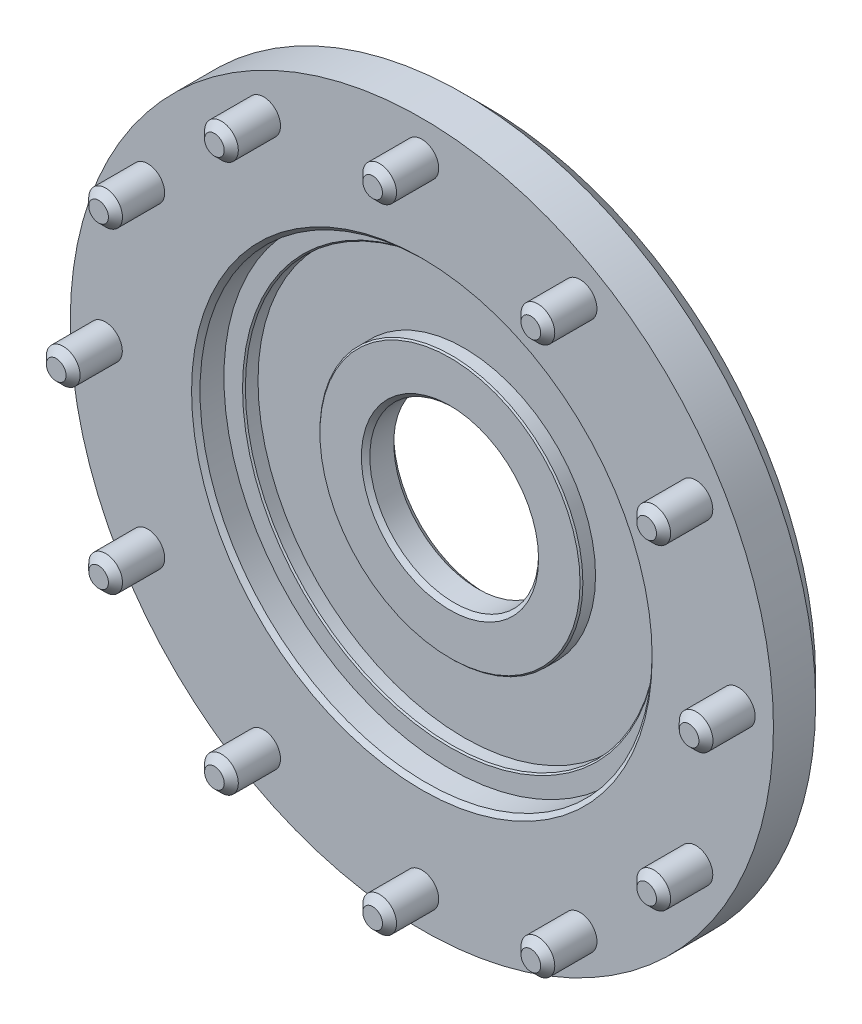
ISO-10303-21;
HEADER;
FILE_DESCRIPTION(('STEP AP214'),'2;1');
FILE_NAME('part.step','',(''),(''),'','','');
FILE_SCHEMA(('AUTOMOTIVE_DESIGN { 1 0 10303 214 1 1 1 1 }'));
ENDSEC;
DATA;
#1=APPLICATION_CONTEXT('core data for automotive mechanical design processes');
#2=APPLICATION_PROTOCOL_DEFINITION('international standard','automotive_design',2000,#1);
#3=PRODUCT_CONTEXT('',#1,'mechanical');
#4=PRODUCT('Part','Part','',(#3));
#5=PRODUCT_RELATED_PRODUCT_CATEGORY('part','',(#4));
#6=PRODUCT_DEFINITION_FORMATION('','',#4);
#7=PRODUCT_DEFINITION_CONTEXT('part definition',#1,'design');
#8=PRODUCT_DEFINITION('design','',#6,#7);
#9=PRODUCT_DEFINITION_SHAPE('','',#8);
#10=(LENGTH_UNIT() NAMED_UNIT(*) SI_UNIT(.MILLI.,.METRE.));
#11=(NAMED_UNIT(*) PLANE_ANGLE_UNIT() SI_UNIT($,.RADIAN.));
#12=(NAMED_UNIT(*) SI_UNIT($,.STERADIAN.) SOLID_ANGLE_UNIT());
#13=UNCERTAINTY_MEASURE_WITH_UNIT(LENGTH_MEASURE(1.E-05),#10,'distance_accuracy_value','');
#14=(GEOMETRIC_REPRESENTATION_CONTEXT(3) GLOBAL_UNCERTAINTY_ASSIGNED_CONTEXT((#13)) GLOBAL_UNIT_ASSIGNED_CONTEXT((#10,
#11,#12)) REPRESENTATION_CONTEXT('',''));
#15=CARTESIAN_POINT('',(0.,0.,0.));
#16=DIRECTION('',(0.,0.,1.));
#17=DIRECTION('',(1.,0.,0.));
#18=AXIS2_PLACEMENT_3D('',#15,#16,#17);
#19=CARTESIAN_POINT('',(0.,0.,-4.));
#20=DIRECTION('',(0.,0.,1.));
#21=DIRECTION('',(1.,0.,0.));
#22=AXIS2_PLACEMENT_3D('',#19,#20,#21);
#23=PLANE('',#22);
#24=CARTESIAN_POINT('',(0.,0.,-4.));
#25=DIRECTION('',(0.,0.,1.));
#26=DIRECTION('',(1.,0.,0.));
#27=AXIS2_PLACEMENT_3D('',#24,#25,#26);
#28=CIRCLE('',#27,12.6);
#29=CARTESIAN_POINT('',(12.6,0.,-4.));
#30=VERTEX_POINT('',#29);
#31=EDGE_CURVE('E10',#30,#30,#28,.F.);
#32=ORIENTED_EDGE('',*,*,#31,.T.);
#33=EDGE_LOOP('',(#32));
#34=FACE_BOUND('',#33,.T.);
#35=CARTESIAN_POINT('',(0.,0.,-4.));
#36=DIRECTION('',(0.,0.,1.));
#37=DIRECTION('',(1.,0.,0.));
#38=AXIS2_PLACEMENT_3D('',#35,#36,#37);
#39=CIRCLE('',#38,18.5);
#40=CARTESIAN_POINT('',(18.5,0.,-4.));
#41=VERTEX_POINT('',#40);
#42=EDGE_CURVE('E72',#41,#41,#39,.T.);
#43=ORIENTED_EDGE('',*,*,#42,.T.);
#44=EDGE_LOOP('',(#43));
#45=FACE_BOUND('',#44,.T.);
#46=ADVANCED_FACE('F36',(#34,#45),#23,.T.);
#47=CARTESIAN_POINT('',(0.,0.,-9.));
#48=DIRECTION('',(0.,0.,1.));
#49=DIRECTION('',(1.,0.,0.));
#50=AXIS2_PLACEMENT_3D('',#47,#48,#49);
#51=CYLINDRICAL_SURFACE('',#50,50.);
#52=CARTESIAN_POINT('',(0.,0.,-6.00000000000001));
#53=DIRECTION('',(0.,0.,1.));
#54=DIRECTION('',(1.,0.,0.));
#55=AXIS2_PLACEMENT_3D('',#52,#53,#54);
#56=CIRCLE('',#55,50.);
#57=CARTESIAN_POINT('',(50.,0.,-6.00000000000001));
#58=VERTEX_POINT('',#57);
#59=EDGE_CURVE('E60',#58,#58,#56,.T.);
#60=ORIENTED_EDGE('',*,*,#59,.T.);
#61=EDGE_LOOP('',(#60));
#62=FACE_BOUND('',#61,.T.);
#63=CARTESIAN_POINT('',(0.,0.,0.));
#64=DIRECTION('',(0.,0.,1.));
#65=DIRECTION('',(1.,0.,0.));
#66=AXIS2_PLACEMENT_3D('',#63,#64,#65);
#67=CIRCLE('',#66,50.);
#68=CARTESIAN_POINT('',(50.,0.,0.));
#69=VERTEX_POINT('',#68);
#70=EDGE_CURVE('E153',#69,#69,#67,.T.);
#71=ORIENTED_EDGE('',*,*,#70,.F.);
#72=EDGE_LOOP('',(#71));
#73=FACE_BOUND('',#72,.T.);
#74=ADVANCED_FACE('F223',(#62,#73),#51,.T.);
#75=CARTESIAN_POINT('',(0.,0.,-9.));
#76=DIRECTION('',(0.,0.,1.));
#77=DIRECTION('',(1.,0.,0.));
#78=AXIS2_PLACEMENT_3D('',#75,#76,#77);
#79=PLANE('',#78);
#80=CARTESIAN_POINT('',(0.,0.,-9.));
#81=DIRECTION('',(0.,0.,1.));
#82=DIRECTION('',(1.,0.,0.));
#83=AXIS2_PLACEMENT_3D('',#80,#81,#82);
#84=CIRCLE('',#83,13.);
#85=CARTESIAN_POINT('',(13.,0.,-9.));
#86=VERTEX_POINT('',#85);
#87=EDGE_CURVE('E52',#86,#86,#84,.T.);
#88=ORIENTED_EDGE('',*,*,#87,.T.);
#89=EDGE_LOOP('',(#88));
#90=FACE_BOUND('',#89,.T.);
#91=CARTESIAN_POINT('',(0.,0.,-9.));
#92=DIRECTION('',(0.,0.,1.));
#93=DIRECTION('',(1.,0.,0.));
#94=AXIS2_PLACEMENT_3D('',#91,#92,#93);
#95=CIRCLE('',#94,47.);
#96=CARTESIAN_POINT('',(47.,0.,-9.));
#97=VERTEX_POINT('',#96);
#98=EDGE_CURVE('E57',#97,#97,#95,.F.);
#99=ORIENTED_EDGE('',*,*,#98,.T.);
#100=EDGE_LOOP('',(#99));
#101=FACE_BOUND('',#100,.T.);
#102=ADVANCED_FACE('F229',(#90,#101),#79,.F.);
#103=CARTESIAN_POINT('',(0.,0.,0.));
#104=DIRECTION('',(0.,0.,1.));
#105=DIRECTION('',(1.,0.,0.));
#106=AXIS2_PLACEMENT_3D('',#103,#104,#105);
#107=PLANE('',#106);
#108=CARTESIAN_POINT('',(0.,0.,0.));
#109=DIRECTION('',(0.,0.,1.));
#110=DIRECTION('',(1.,0.,0.));
#111=AXIS2_PLACEMENT_3D('',#108,#109,#110);
#112=CIRCLE('',#111,32.75);
#113=CARTESIAN_POINT('',(32.75,0.,0.));
#114=VERTEX_POINT('',#113);
#115=EDGE_CURVE('E75',#114,#114,#112,.F.);
#116=ORIENTED_EDGE('',*,*,#115,.T.);
#117=EDGE_LOOP('',(#116));
#118=FACE_BOUND('',#117,.T.);
#119=CARTESIAN_POINT('',(38.9711431703,-22.4999999999995,0.));
#120=DIRECTION('',(0.,0.,1.));
#121=DIRECTION('',(0.866025403784445,-0.499999999999989,0.));
#122=AXIS2_PLACEMENT_3D('',#119,#120,#121);
#123=CIRCLE('',#122,2.4);
#124=CARTESIAN_POINT('',(41.0496041393827,-23.6999999999995,0.));
#125=VERTEX_POINT('',#124);
#126=EDGE_CURVE('E189',#125,#125,#123,.T.);
#127=ORIENTED_EDGE('',*,*,#126,.F.);
#128=EDGE_LOOP('',(#127));
#129=FACE_BOUND('',#128,.T.);
#130=CARTESIAN_POINT('',(22.5000000000005,-38.9711431702995,0.));
#131=DIRECTION('',(0.,0.,1.));
#132=DIRECTION('',(0.50000000000001,-0.866025403784433,0.));
#133=AXIS2_PLACEMENT_3D('',#130,#131,#132);
#134=CIRCLE('',#133,2.4);
#135=CARTESIAN_POINT('',(23.7000000000005,-41.0496041393821,0.));
#136=VERTEX_POINT('',#135);
#137=EDGE_CURVE('E186',#136,#136,#134,.T.);
#138=ORIENTED_EDGE('',*,*,#137,.F.);
#139=EDGE_LOOP('',(#138));
#140=FACE_BOUND('',#139,.T.);
#141=CARTESIAN_POINT('',(4.71349980743823E-13,-45.,0.));
#142=DIRECTION('',(0.,0.,1.));
#143=DIRECTION('',(0.,-1.,0.));
#144=AXIS2_PLACEMENT_3D('',#141,#142,#143);
#145=CIRCLE('',#144,2.4);
#146=CARTESIAN_POINT('',(4.96488646383494E-13,-47.4,0.));
#147=VERTEX_POINT('',#146);
#148=EDGE_CURVE('E183',#147,#147,#145,.T.);
#149=ORIENTED_EDGE('',*,*,#148,.F.);
#150=EDGE_LOOP('',(#149));
#151=FACE_BOUND('',#150,.T.);
#152=CARTESIAN_POINT('',(-22.4999999999996,-38.9711431703,0.));
#153=DIRECTION('',(0.,0.,1.));
#154=DIRECTION('',(-0.499999999999992,-0.866025403784443,0.));
#155=AXIS2_PLACEMENT_3D('',#152,#153,#154);
#156=CIRCLE('',#155,2.4);
#157=CARTESIAN_POINT('',(-23.6999999999996,-41.0496041393826,0.));
#158=VERTEX_POINT('',#157);
#159=EDGE_CURVE('E180',#158,#158,#156,.T.);
#160=ORIENTED_EDGE('',*,*,#159,.F.);
#161=EDGE_LOOP('',(#160));
#162=FACE_BOUND('',#161,.T.);
#163=CARTESIAN_POINT('',(-38.9711431702996,-22.5000000000003,0.));
#164=DIRECTION('',(0.,0.,1.));
#165=DIRECTION('',(-0.866025403784435,-0.500000000000007,0.));
#166=AXIS2_PLACEMENT_3D('',#163,#164,#165);
#167=CIRCLE('',#166,2.4);
#168=CARTESIAN_POINT('',(-41.0496041393822,-23.7000000000003,0.));
#169=VERTEX_POINT('',#168);
#170=EDGE_CURVE('E177',#169,#169,#167,.T.);
#171=ORIENTED_EDGE('',*,*,#170,.F.);
#172=EDGE_LOOP('',(#171));
#173=FACE_BOUND('',#172,.T.);
#174=CARTESIAN_POINT('',(-45.,0.,0.));
#175=DIRECTION('',(0.,0.,1.));
#176=DIRECTION('',(-1.,0.,0.));
#177=AXIS2_PLACEMENT_3D('',#174,#175,#176);
#178=CIRCLE('',#177,2.4);
#179=CARTESIAN_POINT('',(-47.4,0.,0.));
#180=VERTEX_POINT('',#179);
#181=EDGE_CURVE('E174',#180,#180,#178,.T.);
#182=ORIENTED_EDGE('',*,*,#181,.F.);
#183=EDGE_LOOP('',(#182));
#184=FACE_BOUND('',#183,.T.);
#185=CARTESIAN_POINT('',(-38.9711431702999,22.4999999999998,0.));
#186=DIRECTION('',(0.,0.,1.));
#187=DIRECTION('',(-0.866025403784442,0.499999999999995,0.));
#188=AXIS2_PLACEMENT_3D('',#185,#186,#187);
#189=CIRCLE('',#188,2.4);
#190=CARTESIAN_POINT('',(-41.0496041393825,23.6999999999998,0.));
#191=VERTEX_POINT('',#190);
#192=EDGE_CURVE('E171',#191,#191,#189,.T.);
#193=ORIENTED_EDGE('',*,*,#192,.F.);
#194=EDGE_LOOP('',(#193));
#195=FACE_BOUND('',#194,.T.);
#196=CARTESIAN_POINT('',(-22.5000000000002,38.9711431702996,0.));
#197=DIRECTION('',(0.,0.,1.));
#198=DIRECTION('',(-0.500000000000004,0.866025403784436,0.));
#199=AXIS2_PLACEMENT_3D('',#196,#197,#198);
#200=CIRCLE('',#199,2.4);
#201=CARTESIAN_POINT('',(-23.7000000000002,41.0496041393823,0.));
#202=VERTEX_POINT('',#201);
#203=EDGE_CURVE('E168',#202,#202,#200,.T.);
#204=ORIENTED_EDGE('',*,*,#203,.F.);
#205=EDGE_LOOP('',(#204));
#206=FACE_BOUND('',#205,.T.);
#207=CARTESIAN_POINT('',(-1.57116660247941E-13,45.,0.));
#208=DIRECTION('',(0.,0.,1.));
#209=DIRECTION('',(0.,1.,0.));
#210=AXIS2_PLACEMENT_3D('',#207,#208,#209);
#211=CIRCLE('',#210,2.4);
#212=CARTESIAN_POINT('',(-1.65496215461165E-13,47.4,0.));
#213=VERTEX_POINT('',#212);
#214=EDGE_CURVE('E165',#213,#213,#211,.T.);
#215=ORIENTED_EDGE('',*,*,#214,.F.);
#216=EDGE_LOOP('',(#215));
#217=FACE_BOUND('',#216,.T.);
#218=CARTESIAN_POINT('',(22.4999999999999,38.9711431702998,0.));
#219=DIRECTION('',(0.,0.,1.));
#220=DIRECTION('',(0.499999999999998,0.86602540378444,0.));
#221=AXIS2_PLACEMENT_3D('',#218,#219,#220);
#222=CIRCLE('',#221,2.4);
#223=CARTESIAN_POINT('',(23.6999999999999,41.0496041393825,0.));
#224=VERTEX_POINT('',#223);
#225=EDGE_CURVE('E162',#224,#224,#222,.T.);
#226=ORIENTED_EDGE('',*,*,#225,.F.);
#227=EDGE_LOOP('',(#226));
#228=FACE_BOUND('',#227,.T.);
#229=CARTESIAN_POINT('',(38.9711431702997,22.5,0.));
#230=DIRECTION('',(0.,0.,1.));
#231=DIRECTION('',(0.866025403784438,0.500000000000001,0.));
#232=AXIS2_PLACEMENT_3D('',#229,#230,#231);
#233=CIRCLE('',#232,2.4);
#234=CARTESIAN_POINT('',(41.0496041393824,23.7000000000001,0.));
#235=VERTEX_POINT('',#234);
#236=EDGE_CURVE('E159',#235,#235,#233,.T.);
#237=ORIENTED_EDGE('',*,*,#236,.F.);
#238=EDGE_LOOP('',(#237));
#239=FACE_BOUND('',#238,.T.);
#240=CARTESIAN_POINT('',(45.,0.,0.));
#241=DIRECTION('',(0.,0.,1.));
#242=DIRECTION('',(1.,0.,0.));
#243=AXIS2_PLACEMENT_3D('',#240,#241,#242);
#244=CIRCLE('',#243,2.4);
#245=CARTESIAN_POINT('',(47.4,0.,0.));
#246=VERTEX_POINT('',#245);
#247=EDGE_CURVE('E156',#246,#246,#244,.T.);
#248=ORIENTED_EDGE('',*,*,#247,.F.);
#249=EDGE_LOOP('',(#248));
#250=FACE_BOUND('',#249,.T.);
#251=ORIENTED_EDGE('',*,*,#70,.T.);
#252=EDGE_LOOP('',(#251));
#253=FACE_BOUND('',#252,.T.);
#254=ADVANCED_FACE('F286',(#118,#129,#140,#151,#162,#173,#184,#195,#206,#217,#228,#239,#250,
#253),#107,.T.);
#255=CARTESIAN_POINT('',(45.,0.,7.));
#256=DIRECTION('',(0.,0.,-1.));
#257=DIRECTION('',(-1.,0.,0.));
#258=AXIS2_PLACEMENT_3D('',#255,#256,#257);
#259=CYLINDRICAL_SURFACE('',#258,2.4);
#260=CARTESIAN_POINT('',(45.,0.,5.99999999999999));
#261=DIRECTION('',(0.,0.,1.));
#262=DIRECTION('',(1.,0.,0.));
#263=AXIS2_PLACEMENT_3D('',#260,#261,#262);
#264=CIRCLE('',#263,2.4);
#265=CARTESIAN_POINT('',(47.4,0.,5.99999999999999));
#266=VERTEX_POINT('',#265);
#267=EDGE_CURVE('E147',#266,#266,#264,.F.);
#268=ORIENTED_EDGE('',*,*,#267,.T.);
#269=EDGE_LOOP('',(#268));
#270=FACE_BOUND('',#269,.T.);
#271=ORIENTED_EDGE('',*,*,#247,.T.);
#272=EDGE_LOOP('',(#271));
#273=FACE_BOUND('',#272,.T.);
#274=ADVANCED_FACE('F295',(#270,#273),#259,.T.);
#275=CARTESIAN_POINT('',(45.,0.,7.));
#276=DIRECTION('',(0.,0.,1.));
#277=DIRECTION('',(1.,0.,0.));
#278=AXIS2_PLACEMENT_3D('',#275,#276,#277);
#279=PLANE('',#278);
#280=CARTESIAN_POINT('',(45.,0.,7.));
#281=DIRECTION('',(0.,0.,1.));
#282=DIRECTION('',(1.,0.,0.));
#283=AXIS2_PLACEMENT_3D('',#280,#281,#282);
#284=CIRCLE('',#283,1.4);
#285=CARTESIAN_POINT('',(46.4,0.,7.));
#286=VERTEX_POINT('',#285);
#287=EDGE_CURVE('E150',#286,#286,#284,.T.);
#288=ORIENTED_EDGE('',*,*,#287,.T.);
#289=EDGE_LOOP('',(#288));
#290=FACE_BOUND('',#289,.T.);
#291=ADVANCED_FACE('F301',(#290),#279,.T.);
#292=CARTESIAN_POINT('',(45.,0.,7.));
#293=DIRECTION('',(0.,0.,-1.));
#294=DIRECTION('',(-1.,0.,0.));
#295=AXIS2_PLACEMENT_3D('',#292,#293,#294);
#296=CONICAL_SURFACE('',#295,1.4,0.785398163397443);
#297=ORIENTED_EDGE('',*,*,#267,.F.);
#298=EDGE_LOOP('',(#297));
#299=FACE_BOUND('',#298,.T.);
#300=ORIENTED_EDGE('',*,*,#287,.F.);
#301=EDGE_LOOP('',(#300));
#302=FACE_BOUND('',#301,.T.);
#303=ADVANCED_FACE('F307',(#299,#302),#296,.T.);
#304=CARTESIAN_POINT('',(38.9711431702997,22.5,7.));
#305=DIRECTION('',(0.,0.,-1.));
#306=DIRECTION('',(-1.,0.,0.));
#307=AXIS2_PLACEMENT_3D('',#304,#305,#306);
#308=CYLINDRICAL_SURFACE('',#307,2.4);
#309=CARTESIAN_POINT('',(38.9711431702997,22.5,5.99999999999998));
#310=DIRECTION('',(0.,0.,1.));
#311=DIRECTION('',(1.,0.,0.));
#312=AXIS2_PLACEMENT_3D('',#309,#310,#311);
#313=CIRCLE('',#312,2.4);
#314=CARTESIAN_POINT('',(41.3711431702997,22.5,5.99999999999998));
#315=VERTEX_POINT('',#314);
#316=EDGE_CURVE('E141',#315,#315,#313,.F.);
#317=ORIENTED_EDGE('',*,*,#316,.T.);
#318=EDGE_LOOP('',(#317));
#319=FACE_BOUND('',#318,.T.);
#320=ORIENTED_EDGE('',*,*,#236,.T.);
#321=EDGE_LOOP('',(#320));
#322=FACE_BOUND('',#321,.T.);
#323=ADVANCED_FACE('F313',(#319,#322),#308,.T.);
#324=CARTESIAN_POINT('',(38.9711431702997,22.5,7.));
#325=DIRECTION('',(0.,0.,1.));
#326=DIRECTION('',(0.866025403784438,0.500000000000001,0.));
#327=AXIS2_PLACEMENT_3D('',#324,#325,#326);
#328=PLANE('',#327);
#329=CARTESIAN_POINT('',(38.9711431702997,22.5,7.));
#330=DIRECTION('',(0.,0.,1.));
#331=DIRECTION('',(1.,0.,0.));
#332=AXIS2_PLACEMENT_3D('',#329,#330,#331);
#333=CIRCLE('',#332,1.39999999999998);
#334=CARTESIAN_POINT('',(40.3711431702997,22.5,7.));
#335=VERTEX_POINT('',#334);
#336=EDGE_CURVE('E144',#335,#335,#333,.T.);
#337=ORIENTED_EDGE('',*,*,#336,.T.);
#338=EDGE_LOOP('',(#337));
#339=FACE_BOUND('',#338,.T.);
#340=ADVANCED_FACE('F481',(#339),#328,.T.);
#341=CARTESIAN_POINT('',(22.4999999999999,38.9711431702998,7.));
#342=DIRECTION('',(0.,0.,-1.));
#343=DIRECTION('',(-1.,0.,0.));
#344=AXIS2_PLACEMENT_3D('',#341,#342,#343);
#345=CYLINDRICAL_SURFACE('',#344,2.4);
#346=CARTESIAN_POINT('',(22.4999999999999,38.9711431702998,6.00000000000001));
#347=DIRECTION('',(0.,0.,1.));
#348=DIRECTION('',(1.,0.,0.));
#349=AXIS2_PLACEMENT_3D('',#346,#347,#348);
#350=CIRCLE('',#349,2.4);
#351=CARTESIAN_POINT('',(24.8999999999999,38.9711431702998,6.00000000000001));
#352=VERTEX_POINT('',#351);
#353=EDGE_CURVE('E135',#352,#352,#350,.F.);
#354=ORIENTED_EDGE('',*,*,#353,.T.);
#355=EDGE_LOOP('',(#354));
#356=FACE_BOUND('',#355,.T.);
#357=ORIENTED_EDGE('',*,*,#225,.T.);
#358=EDGE_LOOP('',(#357));
#359=FACE_BOUND('',#358,.T.);
#360=ADVANCED_FACE('F477',(#356,#359),#345,.T.);
#361=CARTESIAN_POINT('',(22.4999999999999,38.9711431702998,7.));
#362=DIRECTION('',(0.,0.,1.));
#363=DIRECTION('',(0.499999999999998,0.86602540378444,0.));
#364=AXIS2_PLACEMENT_3D('',#361,#362,#363);
#365=PLANE('',#364);
#366=CARTESIAN_POINT('',(22.4999999999999,38.9711431702998,7.));
#367=DIRECTION('',(0.,0.,1.));
#368=DIRECTION('',(1.,0.,0.));
#369=AXIS2_PLACEMENT_3D('',#366,#367,#368);
#370=CIRCLE('',#369,1.40000000000001);
#371=CARTESIAN_POINT('',(23.8999999999999,38.9711431702998,7.));
#372=VERTEX_POINT('',#371);
#373=EDGE_CURVE('E138',#372,#372,#370,.T.);
#374=ORIENTED_EDGE('',*,*,#373,.T.);
#375=EDGE_LOOP('',(#374));
#376=FACE_BOUND('',#375,.T.);
#377=ADVANCED_FACE('F473',(#376),#365,.T.);
#378=CARTESIAN_POINT('',(-1.57116660247941E-13,45.,7.));
#379=DIRECTION('',(0.,0.,-1.));
#380=DIRECTION('',(-1.,0.,0.));
#381=AXIS2_PLACEMENT_3D('',#378,#379,#380);
#382=CYLINDRICAL_SURFACE('',#381,2.4);
#383=CARTESIAN_POINT('',(-1.57116660247941E-13,45.,5.99999999999999));
#384=DIRECTION('',(0.,0.,1.));
#385=DIRECTION('',(1.,0.,0.));
#386=AXIS2_PLACEMENT_3D('',#383,#384,#385);
#387=CIRCLE('',#386,2.4);
#388=CARTESIAN_POINT('',(2.39999999999984,45.,5.99999999999999));
#389=VERTEX_POINT('',#388);
#390=EDGE_CURVE('E129',#389,#389,#387,.F.);
#391=ORIENTED_EDGE('',*,*,#390,.T.);
#392=EDGE_LOOP('',(#391));
#393=FACE_BOUND('',#392,.T.);
#394=ORIENTED_EDGE('',*,*,#214,.T.);
#395=EDGE_LOOP('',(#394));
#396=FACE_BOUND('',#395,.T.);
#397=ADVANCED_FACE('F469',(#393,#396),#382,.T.);
#398=CARTESIAN_POINT('',(-1.57116660247941E-13,45.,7.));
#399=DIRECTION('',(0.,0.,1.));
#400=DIRECTION('',(0.,1.,0.));
#401=AXIS2_PLACEMENT_3D('',#398,#399,#400);
#402=PLANE('',#401);
#403=CARTESIAN_POINT('',(-1.57116660247941E-13,45.,7.));
#404=DIRECTION('',(0.,0.,1.));
#405=DIRECTION('',(1.,0.,0.));
#406=AXIS2_PLACEMENT_3D('',#403,#404,#405);
#407=CIRCLE('',#406,1.4);
#408=CARTESIAN_POINT('',(1.39999999999984,45.,7.));
#409=VERTEX_POINT('',#408);
#410=EDGE_CURVE('E132',#409,#409,#407,.T.);
#411=ORIENTED_EDGE('',*,*,#410,.T.);
#412=EDGE_LOOP('',(#411));
#413=FACE_BOUND('',#412,.T.);
#414=ADVANCED_FACE('F465',(#413),#402,.T.);
#415=CARTESIAN_POINT('',(-22.5000000000002,38.9711431702996,7.));
#416=DIRECTION('',(0.,0.,-1.));
#417=DIRECTION('',(-1.,0.,0.));
#418=AXIS2_PLACEMENT_3D('',#415,#416,#417);
#419=CYLINDRICAL_SURFACE('',#418,2.4);
#420=CARTESIAN_POINT('',(-22.5000000000002,38.9711431702996,6.00000000000003));
#421=DIRECTION('',(0.,0.,1.));
#422=DIRECTION('',(1.,0.,0.));
#423=AXIS2_PLACEMENT_3D('',#420,#421,#422);
#424=CIRCLE('',#423,2.4);
#425=CARTESIAN_POINT('',(-20.1000000000002,38.9711431702996,6.00000000000003));
#426=VERTEX_POINT('',#425);
#427=EDGE_CURVE('E123',#426,#426,#424,.F.);
#428=ORIENTED_EDGE('',*,*,#427,.T.);
#429=EDGE_LOOP('',(#428));
#430=FACE_BOUND('',#429,.T.);
#431=ORIENTED_EDGE('',*,*,#203,.T.);
#432=EDGE_LOOP('',(#431));
#433=FACE_BOUND('',#432,.T.);
#434=ADVANCED_FACE('F461',(#430,#433),#419,.T.);
#435=CARTESIAN_POINT('',(-22.5000000000002,38.9711431702996,7.));
#436=DIRECTION('',(0.,0.,1.));
#437=DIRECTION('',(-0.500000000000004,0.866025403784436,0.));
#438=AXIS2_PLACEMENT_3D('',#435,#436,#437);
#439=PLANE('',#438);
#440=CARTESIAN_POINT('',(-22.5000000000002,38.9711431702996,7.));
#441=DIRECTION('',(0.,0.,1.));
#442=DIRECTION('',(1.,0.,0.));
#443=AXIS2_PLACEMENT_3D('',#440,#441,#442);
#444=CIRCLE('',#443,1.40000000000003);
#445=CARTESIAN_POINT('',(-21.1000000000002,38.9711431702996,7.));
#446=VERTEX_POINT('',#445);
#447=EDGE_CURVE('E126',#446,#446,#444,.T.);
#448=ORIENTED_EDGE('',*,*,#447,.T.);
#449=EDGE_LOOP('',(#448));
#450=FACE_BOUND('',#449,.T.);
#451=ADVANCED_FACE('F457',(#450),#439,.T.);
#452=CARTESIAN_POINT('',(-38.9711431702999,22.4999999999998,7.));
#453=DIRECTION('',(0.,0.,-1.));
#454=DIRECTION('',(-1.,0.,0.));
#455=AXIS2_PLACEMENT_3D('',#452,#453,#454);
#456=CYLINDRICAL_SURFACE('',#455,2.4);
#457=CARTESIAN_POINT('',(-38.9711431702999,22.4999999999998,5.99999999999998));
#458=DIRECTION('',(0.,0.,1.));
#459=DIRECTION('',(1.,0.,0.));
#460=AXIS2_PLACEMENT_3D('',#457,#458,#459);
#461=CIRCLE('',#460,2.4);
#462=CARTESIAN_POINT('',(-36.5711431702999,22.4999999999998,5.99999999999998));
#463=VERTEX_POINT('',#462);
#464=EDGE_CURVE('E117',#463,#463,#461,.F.);
#465=ORIENTED_EDGE('',*,*,#464,.T.);
#466=EDGE_LOOP('',(#465));
#467=FACE_BOUND('',#466,.T.);
#468=ORIENTED_EDGE('',*,*,#192,.T.);
#469=EDGE_LOOP('',(#468));
#470=FACE_BOUND('',#469,.T.);
#471=ADVANCED_FACE('F453',(#467,#470),#456,.T.);
#472=CARTESIAN_POINT('',(-38.9711431702999,22.4999999999998,7.));
#473=DIRECTION('',(0.,0.,1.));
#474=DIRECTION('',(-0.866025403784442,0.499999999999995,0.));
#475=AXIS2_PLACEMENT_3D('',#472,#473,#474);
#476=PLANE('',#475);
#477=CARTESIAN_POINT('',(-38.9711431702999,22.4999999999998,7.));
#478=DIRECTION('',(0.,0.,1.));
#479=DIRECTION('',(1.,0.,0.));
#480=AXIS2_PLACEMENT_3D('',#477,#478,#479);
#481=CIRCLE('',#480,1.39999999999996);
#482=CARTESIAN_POINT('',(-37.5711431702999,22.4999999999998,7.));
#483=VERTEX_POINT('',#482);
#484=EDGE_CURVE('E120',#483,#483,#481,.T.);
#485=ORIENTED_EDGE('',*,*,#484,.T.);
#486=EDGE_LOOP('',(#485));
#487=FACE_BOUND('',#486,.T.);
#488=ADVANCED_FACE('F449',(#487),#476,.T.);
#489=CARTESIAN_POINT('',(-45.,0.,7.));
#490=DIRECTION('',(0.,0.,-1.));
#491=DIRECTION('',(-1.,0.,0.));
#492=AXIS2_PLACEMENT_3D('',#489,#490,#491);
#493=CYLINDRICAL_SURFACE('',#492,2.4);
#494=CARTESIAN_POINT('',(-45.,0.,5.99999999999999));
#495=DIRECTION('',(0.,0.,1.));
#496=DIRECTION('',(1.,0.,0.));
#497=AXIS2_PLACEMENT_3D('',#494,#495,#496);
#498=CIRCLE('',#497,2.4);
#499=CARTESIAN_POINT('',(-42.6,0.,5.99999999999999));
#500=VERTEX_POINT('',#499);
#501=EDGE_CURVE('E111',#500,#500,#498,.F.);
#502=ORIENTED_EDGE('',*,*,#501,.T.);
#503=EDGE_LOOP('',(#502));
#504=FACE_BOUND('',#503,.T.);
#505=ORIENTED_EDGE('',*,*,#181,.T.);
#506=EDGE_LOOP('',(#505));
#507=FACE_BOUND('',#506,.T.);
#508=ADVANCED_FACE('F445',(#504,#507),#493,.T.);
#509=CARTESIAN_POINT('',(-45.,0.,7.));
#510=DIRECTION('',(0.,0.,1.));
#511=DIRECTION('',(-1.,0.,0.));
#512=AXIS2_PLACEMENT_3D('',#509,#510,#511);
#513=PLANE('',#512);
#514=CARTESIAN_POINT('',(-45.,0.,7.));
#515=DIRECTION('',(0.,0.,1.));
#516=DIRECTION('',(1.,0.,0.));
#517=AXIS2_PLACEMENT_3D('',#514,#515,#516);
#518=CIRCLE('',#517,1.4);
#519=CARTESIAN_POINT('',(-43.6,0.,7.));
#520=VERTEX_POINT('',#519);
#521=EDGE_CURVE('E114',#520,#520,#518,.T.);
#522=ORIENTED_EDGE('',*,*,#521,.T.);
#523=EDGE_LOOP('',(#522));
#524=FACE_BOUND('',#523,.T.);
#525=ADVANCED_FACE('F441',(#524),#513,.T.);
#526=CARTESIAN_POINT('',(-38.9711431702996,-22.5000000000003,7.));
#527=DIRECTION('',(0.,0.,-1.));
#528=DIRECTION('',(-1.,0.,0.));
#529=AXIS2_PLACEMENT_3D('',#526,#527,#528);
#530=CYLINDRICAL_SURFACE('',#529,2.4);
#531=CARTESIAN_POINT('',(-38.9711431702996,-22.5000000000003,6.00000000000001));
#532=DIRECTION('',(0.,0.,1.));
#533=DIRECTION('',(1.,0.,0.));
#534=AXIS2_PLACEMENT_3D('',#531,#532,#533);
#535=CIRCLE('',#534,2.4);
#536=CARTESIAN_POINT('',(-36.5711431702996,-22.5000000000003,6.00000000000001));
#537=VERTEX_POINT('',#536);
#538=EDGE_CURVE('E105',#537,#537,#535,.F.);
#539=ORIENTED_EDGE('',*,*,#538,.T.);
#540=EDGE_LOOP('',(#539));
#541=FACE_BOUND('',#540,.T.);
#542=ORIENTED_EDGE('',*,*,#170,.T.);
#543=EDGE_LOOP('',(#542));
#544=FACE_BOUND('',#543,.T.);
#545=ADVANCED_FACE('F437',(#541,#544),#530,.T.);
#546=CARTESIAN_POINT('',(-38.9711431702996,-22.5000000000003,7.));
#547=DIRECTION('',(0.,0.,1.));
#548=DIRECTION('',(-0.866025403784435,-0.500000000000007,0.));
#549=AXIS2_PLACEMENT_3D('',#546,#547,#548);
#550=PLANE('',#549);
#551=CARTESIAN_POINT('',(-38.9711431702996,-22.5000000000003,7.));
#552=DIRECTION('',(0.,0.,1.));
#553=DIRECTION('',(1.,0.,0.));
#554=AXIS2_PLACEMENT_3D('',#551,#552,#553);
#555=CIRCLE('',#554,1.40000000000001);
#556=CARTESIAN_POINT('',(-37.5711431702996,-22.5000000000003,7.));
#557=VERTEX_POINT('',#556);
#558=EDGE_CURVE('E108',#557,#557,#555,.T.);
#559=ORIENTED_EDGE('',*,*,#558,.T.);
#560=EDGE_LOOP('',(#559));
#561=FACE_BOUND('',#560,.T.);
#562=ADVANCED_FACE('F433',(#561),#550,.T.);
#563=CARTESIAN_POINT('',(-22.4999999999996,-38.9711431703,7.));
#564=DIRECTION('',(0.,0.,-1.));
#565=DIRECTION('',(-1.,0.,0.));
#566=AXIS2_PLACEMENT_3D('',#563,#564,#565);
#567=CYLINDRICAL_SURFACE('',#566,2.4);
#568=CARTESIAN_POINT('',(-22.4999999999996,-38.9711431703,5.99999999999998));
#569=DIRECTION('',(0.,0.,1.));
#570=DIRECTION('',(1.,0.,0.));
#571=AXIS2_PLACEMENT_3D('',#568,#569,#570);
#572=CIRCLE('',#571,2.4);
#573=CARTESIAN_POINT('',(-20.0999999999996,-38.9711431703,5.99999999999998));
#574=VERTEX_POINT('',#573);
#575=EDGE_CURVE('E99',#574,#574,#572,.F.);
#576=ORIENTED_EDGE('',*,*,#575,.T.);
#577=EDGE_LOOP('',(#576));
#578=FACE_BOUND('',#577,.T.);
#579=ORIENTED_EDGE('',*,*,#159,.T.);
#580=EDGE_LOOP('',(#579));
#581=FACE_BOUND('',#580,.T.);
#582=ADVANCED_FACE('F429',(#578,#581),#567,.T.);
#583=CARTESIAN_POINT('',(-22.4999999999996,-38.9711431703,7.));
#584=DIRECTION('',(0.,0.,1.));
#585=DIRECTION('',(-0.499999999999992,-0.866025403784443,0.));
#586=AXIS2_PLACEMENT_3D('',#583,#584,#585);
#587=PLANE('',#586);
#588=CARTESIAN_POINT('',(-22.4999999999996,-38.9711431703,7.));
#589=DIRECTION('',(0.,0.,1.));
#590=DIRECTION('',(1.,0.,0.));
#591=AXIS2_PLACEMENT_3D('',#588,#589,#590);
#592=CIRCLE('',#591,1.39999999999997);
#593=CARTESIAN_POINT('',(-21.0999999999997,-38.9711431703,7.));
#594=VERTEX_POINT('',#593);
#595=EDGE_CURVE('E102',#594,#594,#592,.T.);
#596=ORIENTED_EDGE('',*,*,#595,.T.);
#597=EDGE_LOOP('',(#596));
#598=FACE_BOUND('',#597,.T.);
#599=ADVANCED_FACE('F425',(#598),#587,.T.);
#600=CARTESIAN_POINT('',(4.71349980743823E-13,-45.,7.));
#601=DIRECTION('',(0.,0.,-1.));
#602=DIRECTION('',(-1.,0.,0.));
#603=AXIS2_PLACEMENT_3D('',#600,#601,#602);
#604=CYLINDRICAL_SURFACE('',#603,2.4);
#605=CARTESIAN_POINT('',(4.71349980743823E-13,-45.,5.99999999999999));
#606=DIRECTION('',(0.,0.,1.));
#607=DIRECTION('',(1.,0.,0.));
#608=AXIS2_PLACEMENT_3D('',#605,#606,#607);
#609=CIRCLE('',#608,2.4);
#610=CARTESIAN_POINT('',(2.40000000000047,-45.,5.99999999999999));
#611=VERTEX_POINT('',#610);
#612=EDGE_CURVE('E93',#611,#611,#609,.F.);
#613=ORIENTED_EDGE('',*,*,#612,.T.);
#614=EDGE_LOOP('',(#613));
#615=FACE_BOUND('',#614,.T.);
#616=ORIENTED_EDGE('',*,*,#148,.T.);
#617=EDGE_LOOP('',(#616));
#618=FACE_BOUND('',#617,.T.);
#619=ADVANCED_FACE('F421',(#615,#618),#604,.T.);
#620=CARTESIAN_POINT('',(4.71349980743823E-13,-45.,7.));
#621=DIRECTION('',(0.,0.,1.));
#622=DIRECTION('',(0.,-1.,0.));
#623=AXIS2_PLACEMENT_3D('',#620,#621,#622);
#624=PLANE('',#623);
#625=CARTESIAN_POINT('',(4.71349980743823E-13,-45.,7.));
#626=DIRECTION('',(0.,0.,1.));
#627=DIRECTION('',(1.,0.,0.));
#628=AXIS2_PLACEMENT_3D('',#625,#626,#627);
#629=CIRCLE('',#628,1.4);
#630=CARTESIAN_POINT('',(1.40000000000047,-45.,7.));
#631=VERTEX_POINT('',#630);
#632=EDGE_CURVE('E96',#631,#631,#629,.T.);
#633=ORIENTED_EDGE('',*,*,#632,.T.);
#634=EDGE_LOOP('',(#633));
#635=FACE_BOUND('',#634,.T.);
#636=ADVANCED_FACE('F417',(#635),#624,.T.);
#637=CARTESIAN_POINT('',(22.5000000000005,-38.9711431702995,7.));
#638=DIRECTION('',(0.,0.,-1.));
#639=DIRECTION('',(-1.,0.,0.));
#640=AXIS2_PLACEMENT_3D('',#637,#638,#639);
#641=CYLINDRICAL_SURFACE('',#640,2.4);
#642=CARTESIAN_POINT('',(22.5000000000005,-38.9711431702995,6.00000000000001));
#643=DIRECTION('',(0.,0.,1.));
#644=DIRECTION('',(1.,0.,0.));
#645=AXIS2_PLACEMENT_3D('',#642,#643,#644);
#646=CIRCLE('',#645,2.4);
#647=CARTESIAN_POINT('',(24.9000000000005,-38.9711431702995,6.00000000000001));
#648=VERTEX_POINT('',#647);
#649=EDGE_CURVE('E87',#648,#648,#646,.F.);
#650=ORIENTED_EDGE('',*,*,#649,.T.);
#651=EDGE_LOOP('',(#650));
#652=FACE_BOUND('',#651,.T.);
#653=ORIENTED_EDGE('',*,*,#137,.T.);
#654=EDGE_LOOP('',(#653));
#655=FACE_BOUND('',#654,.T.);
#656=ADVANCED_FACE('F413',(#652,#655),#641,.T.);
#657=CARTESIAN_POINT('',(22.5000000000005,-38.9711431702995,7.));
#658=DIRECTION('',(0.,0.,1.));
#659=DIRECTION('',(0.50000000000001,-0.866025403784433,0.));
#660=AXIS2_PLACEMENT_3D('',#657,#658,#659);
#661=PLANE('',#660);
#662=CARTESIAN_POINT('',(22.5000000000005,-38.9711431702995,7.));
#663=DIRECTION('',(0.,0.,1.));
#664=DIRECTION('',(1.,0.,0.));
#665=AXIS2_PLACEMENT_3D('',#662,#663,#664);
#666=CIRCLE('',#665,1.40000000000002);
#667=CARTESIAN_POINT('',(23.9000000000005,-38.9711431702995,7.));
#668=VERTEX_POINT('',#667);
#669=EDGE_CURVE('E90',#668,#668,#666,.T.);
#670=ORIENTED_EDGE('',*,*,#669,.T.);
#671=EDGE_LOOP('',(#670));
#672=FACE_BOUND('',#671,.T.);
#673=ADVANCED_FACE('F407',(#672),#661,.T.);
#674=CARTESIAN_POINT('',(38.9711431703,-22.4999999999995,7.));
#675=DIRECTION('',(0.,0.,-1.));
#676=DIRECTION('',(-1.,0.,0.));
#677=AXIS2_PLACEMENT_3D('',#674,#675,#676);
#678=CYLINDRICAL_SURFACE('',#677,2.4);
#679=CARTESIAN_POINT('',(38.9711431703,-22.4999999999995,5.99999999999999));
#680=DIRECTION('',(0.,0.,1.));
#681=DIRECTION('',(1.,0.,0.));
#682=AXIS2_PLACEMENT_3D('',#679,#680,#681);
#683=CIRCLE('',#682,2.4);
#684=CARTESIAN_POINT('',(41.3711431703,-22.4999999999995,5.99999999999999));
#685=VERTEX_POINT('',#684);
#686=EDGE_CURVE('E81',#685,#685,#683,.F.);
#687=ORIENTED_EDGE('',*,*,#686,.T.);
#688=EDGE_LOOP('',(#687));
#689=FACE_BOUND('',#688,.T.);
#690=ORIENTED_EDGE('',*,*,#126,.T.);
#691=EDGE_LOOP('',(#690));
#692=FACE_BOUND('',#691,.T.);
#693=ADVANCED_FACE('F402',(#689,#692),#678,.T.);
#694=CARTESIAN_POINT('',(38.9711431703,-22.4999999999995,7.));
#695=DIRECTION('',(0.,0.,1.));
#696=DIRECTION('',(0.866025403784445,-0.499999999999989,0.));
#697=AXIS2_PLACEMENT_3D('',#694,#695,#696);
#698=PLANE('',#697);
#699=CARTESIAN_POINT('',(38.9711431703,-22.4999999999995,7.));
#700=DIRECTION('',(0.,0.,1.));
#701=DIRECTION('',(1.,0.,0.));
#702=AXIS2_PLACEMENT_3D('',#699,#700,#701);
#703=CIRCLE('',#702,1.4);
#704=CARTESIAN_POINT('',(40.3711431703,-22.4999999999995,7.));
#705=VERTEX_POINT('',#704);
#706=EDGE_CURVE('E84',#705,#705,#703,.T.);
#707=ORIENTED_EDGE('',*,*,#706,.T.);
#708=EDGE_LOOP('',(#707));
#709=FACE_BOUND('',#708,.T.);
#710=ADVANCED_FACE('F322',(#709),#698,.T.);
#711=CARTESIAN_POINT('',(38.9711431702997,22.5,7.));
#712=DIRECTION('',(0.,0.,-1.));
#713=DIRECTION('',(-1.,0.,0.));
#714=AXIS2_PLACEMENT_3D('',#711,#712,#713);
#715=CONICAL_SURFACE('',#714,1.39999999999998,0.785398163397448);
#716=ORIENTED_EDGE('',*,*,#316,.F.);
#717=EDGE_LOOP('',(#716));
#718=FACE_BOUND('',#717,.T.);
#719=ORIENTED_EDGE('',*,*,#336,.F.);
#720=EDGE_LOOP('',(#719));
#721=FACE_BOUND('',#720,.T.);
#722=ADVANCED_FACE('F315',(#718,#721),#715,.T.);
#723=CARTESIAN_POINT('',(22.4999999999999,38.9711431702998,7.));
#724=DIRECTION('',(0.,0.,-1.));
#725=DIRECTION('',(-1.,0.,0.));
#726=AXIS2_PLACEMENT_3D('',#723,#724,#725);
#727=CONICAL_SURFACE('',#726,1.40000000000001,0.78539816339745);
#728=ORIENTED_EDGE('',*,*,#353,.F.);
#729=EDGE_LOOP('',(#728));
#730=FACE_BOUND('',#729,.T.);
#731=ORIENTED_EDGE('',*,*,#373,.F.);
#732=EDGE_LOOP('',(#731));
#733=FACE_BOUND('',#732,.T.);
#734=ADVANCED_FACE('F321',(#730,#733),#727,.T.);
#735=CARTESIAN_POINT('',(-1.57116660247941E-13,45.,7.));
#736=DIRECTION('',(0.,0.,-1.));
#737=DIRECTION('',(-1.,0.,0.));
#738=AXIS2_PLACEMENT_3D('',#735,#736,#737);
#739=CONICAL_SURFACE('',#738,1.4,0.785398163397443);
#740=ORIENTED_EDGE('',*,*,#390,.F.);
#741=EDGE_LOOP('',(#740));
#742=FACE_BOUND('',#741,.T.);
#743=ORIENTED_EDGE('',*,*,#410,.F.);
#744=EDGE_LOOP('',(#743));
#745=FACE_BOUND('',#744,.T.);
#746=ADVANCED_FACE('F329',(#742,#745),#739,.T.);
#747=CARTESIAN_POINT('',(-22.5000000000002,38.9711431702996,7.));
#748=DIRECTION('',(0.,0.,-1.));
#749=DIRECTION('',(-1.,0.,0.));
#750=AXIS2_PLACEMENT_3D('',#747,#748,#749);
#751=CONICAL_SURFACE('',#750,1.40000000000003,0.785398163397447);
#752=ORIENTED_EDGE('',*,*,#427,.F.);
#753=EDGE_LOOP('',(#752));
#754=FACE_BOUND('',#753,.T.);
#755=ORIENTED_EDGE('',*,*,#447,.F.);
#756=EDGE_LOOP('',(#755));
#757=FACE_BOUND('',#756,.T.);
#758=ADVANCED_FACE('F336',(#754,#757),#751,.T.);
#759=CARTESIAN_POINT('',(-38.9711431702999,22.4999999999998,7.));
#760=DIRECTION('',(0.,0.,-1.));
#761=DIRECTION('',(-1.,0.,0.));
#762=AXIS2_PLACEMENT_3D('',#759,#760,#761);
#763=CONICAL_SURFACE('',#762,1.39999999999996,0.785398163397458);
#764=ORIENTED_EDGE('',*,*,#464,.F.);
#765=EDGE_LOOP('',(#764));
#766=FACE_BOUND('',#765,.T.);
#767=ORIENTED_EDGE('',*,*,#484,.F.);
#768=EDGE_LOOP('',(#767));
#769=FACE_BOUND('',#768,.T.);
#770=ADVANCED_FACE('F343',(#766,#769),#763,.T.);
#771=CARTESIAN_POINT('',(-45.,0.,7.));
#772=DIRECTION('',(0.,0.,-1.));
#773=DIRECTION('',(-1.,0.,0.));
#774=AXIS2_PLACEMENT_3D('',#771,#772,#773);
#775=CONICAL_SURFACE('',#774,1.4,0.785398163397443);
#776=ORIENTED_EDGE('',*,*,#501,.F.);
#777=EDGE_LOOP('',(#776));
#778=FACE_BOUND('',#777,.T.);
#779=ORIENTED_EDGE('',*,*,#521,.F.);
#780=EDGE_LOOP('',(#779));
#781=FACE_BOUND('',#780,.T.);
#782=ADVANCED_FACE('F350',(#778,#781),#775,.T.);
#783=CARTESIAN_POINT('',(-38.9711431702996,-22.5000000000003,7.));
#784=DIRECTION('',(0.,0.,-1.));
#785=DIRECTION('',(-1.,0.,0.));
#786=AXIS2_PLACEMENT_3D('',#783,#784,#785);
#787=CONICAL_SURFACE('',#786,1.40000000000001,0.785398163397451);
#788=ORIENTED_EDGE('',*,*,#538,.F.);
#789=EDGE_LOOP('',(#788));
#790=FACE_BOUND('',#789,.T.);
#791=ORIENTED_EDGE('',*,*,#558,.F.);
#792=EDGE_LOOP('',(#791));
#793=FACE_BOUND('',#792,.T.);
#794=ADVANCED_FACE('F357',(#790,#793),#787,.T.);
#795=CARTESIAN_POINT('',(-22.4999999999996,-38.9711431703,7.));
#796=DIRECTION('',(0.,0.,-1.));
#797=DIRECTION('',(-1.,0.,0.));
#798=AXIS2_PLACEMENT_3D('',#795,#796,#797);
#799=CONICAL_SURFACE('',#798,1.39999999999997,0.785398163397452);
#800=ORIENTED_EDGE('',*,*,#575,.F.);
#801=EDGE_LOOP('',(#800));
#802=FACE_BOUND('',#801,.T.);
#803=ORIENTED_EDGE('',*,*,#595,.F.);
#804=EDGE_LOOP('',(#803));
#805=FACE_BOUND('',#804,.T.);
#806=ADVANCED_FACE('F364',(#802,#805),#799,.T.);
#807=CARTESIAN_POINT('',(4.71349980743823E-13,-45.,7.));
#808=DIRECTION('',(0.,0.,-1.));
#809=DIRECTION('',(-1.,0.,0.));
#810=AXIS2_PLACEMENT_3D('',#807,#808,#809);
#811=CONICAL_SURFACE('',#810,1.4,0.785398163397443);
#812=ORIENTED_EDGE('',*,*,#612,.F.);
#813=EDGE_LOOP('',(#812));
#814=FACE_BOUND('',#813,.T.);
#815=ORIENTED_EDGE('',*,*,#632,.F.);
#816=EDGE_LOOP('',(#815));
#817=FACE_BOUND('',#816,.T.);
#818=ADVANCED_FACE('F371',(#814,#817),#811,.T.);
#819=CARTESIAN_POINT('',(22.5000000000005,-38.9711431702995,7.));
#820=DIRECTION('',(0.,0.,-1.));
#821=DIRECTION('',(-1.,0.,0.));
#822=AXIS2_PLACEMENT_3D('',#819,#820,#821);
#823=CONICAL_SURFACE('',#822,1.40000000000002,0.785398163397443);
#824=ORIENTED_EDGE('',*,*,#649,.F.);
#825=EDGE_LOOP('',(#824));
#826=FACE_BOUND('',#825,.T.);
#827=ORIENTED_EDGE('',*,*,#669,.F.);
#828=EDGE_LOOP('',(#827));
#829=FACE_BOUND('',#828,.T.);
#830=ADVANCED_FACE('F378',(#826,#829),#823,.T.);
#831=CARTESIAN_POINT('',(38.9711431703,-22.4999999999995,7.));
#832=DIRECTION('',(0.,0.,-1.));
#833=DIRECTION('',(-1.,0.,0.));
#834=AXIS2_PLACEMENT_3D('',#831,#832,#833);
#835=CONICAL_SURFACE('',#834,1.4,0.785398163397443);
#836=ORIENTED_EDGE('',*,*,#686,.F.);
#837=EDGE_LOOP('',(#836));
#838=FACE_BOUND('',#837,.T.);
#839=ORIENTED_EDGE('',*,*,#706,.F.);
#840=EDGE_LOOP('',(#839));
#841=FACE_BOUND('',#840,.T.);
#842=ADVANCED_FACE('F241',(#838,#841),#835,.T.);
#843=CARTESIAN_POINT('',(0.,0.,-4.));
#844=DIRECTION('',(0.,0.,1.));
#845=DIRECTION('',(1.,0.,0.));
#846=AXIS2_PLACEMENT_3D('',#843,#844,#845);
#847=CYLINDRICAL_SURFACE('',#846,32.15);
#848=CARTESIAN_POINT('',(0.,0.,-0.600000000000045));
#849=DIRECTION('',(0.,0.,1.));
#850=DIRECTION('',(1.,0.,0.));
#851=AXIS2_PLACEMENT_3D('',#848,#849,#850);
#852=CIRCLE('',#851,32.15);
#853=CARTESIAN_POINT('',(32.15,0.,-0.600000000000045));
#854=VERTEX_POINT('',#853);
#855=EDGE_CURVE('E78',#854,#854,#852,.T.);
#856=ORIENTED_EDGE('',*,*,#855,.T.);
#857=EDGE_LOOP('',(#856));
#858=FACE_BOUND('',#857,.T.);
#859=CARTESIAN_POINT('',(0.,0.,-4.));
#860=DIRECTION('',(0.,0.,1.));
#861=DIRECTION('',(1.,0.,0.));
#862=AXIS2_PLACEMENT_3D('',#859,#860,#861);
#863=CIRCLE('',#862,32.15);
#864=CARTESIAN_POINT('',(32.15,0.,-4.));
#865=VERTEX_POINT('',#864);
#866=EDGE_CURVE('E192',#865,#865,#863,.T.);
#867=ORIENTED_EDGE('',*,*,#866,.F.);
#868=EDGE_LOOP('',(#867));
#869=FACE_BOUND('',#868,.T.);
#870=ADVANCED_FACE('F235',(#858,#869),#847,.F.);
#871=CARTESIAN_POINT('',(0.,0.,-4.));
#872=DIRECTION('',(0.,0.,1.));
#873=DIRECTION('',(1.,0.,0.));
#874=AXIS2_PLACEMENT_3D('',#871,#872,#873);
#875=CIRCLE('',#874,29.5);
#876=CARTESIAN_POINT('',(29.5,0.,-4.));
#877=VERTEX_POINT('',#876);
#878=EDGE_CURVE('E63',#877,#877,#875,.F.);
#879=ORIENTED_EDGE('',*,*,#878,.T.);
#880=EDGE_LOOP('',(#879));
#881=FACE_BOUND('',#880,.T.);
#882=ORIENTED_EDGE('',*,*,#866,.T.);
#883=EDGE_LOOP('',(#882));
#884=FACE_BOUND('',#883,.T.);
#885=ADVANCED_FACE('F225',(#881,#884),#23,.T.);
#886=CARTESIAN_POINT('',(0.,0.,-9.));
#887=DIRECTION('',(0.,0.,1.));
#888=DIRECTION('',(1.,0.,0.));
#889=AXIS2_PLACEMENT_3D('',#886,#887,#888);
#890=CYLINDRICAL_SURFACE('',#889,12.);
#891=CARTESIAN_POINT('',(0.,0.,-4.60000000000001));
#892=DIRECTION('',(0.,0.,1.));
#893=DIRECTION('',(1.,0.,0.));
#894=AXIS2_PLACEMENT_3D('',#891,#892,#893);
#895=CIRCLE('',#894,12.);
#896=CARTESIAN_POINT('',(12.,0.,-4.60000000000001));
#897=VERTEX_POINT('',#896);
#898=EDGE_CURVE('E44',#897,#897,#895,.T.);
#899=ORIENTED_EDGE('',*,*,#898,.T.);
#900=EDGE_LOOP('',(#899));
#901=FACE_BOUND('',#900,.T.);
#902=CARTESIAN_POINT('',(0.,0.,-8.00000000000003));
#903=DIRECTION('',(0.,0.,1.));
#904=DIRECTION('',(1.,0.,0.));
#905=AXIS2_PLACEMENT_3D('',#902,#903,#904);
#906=CIRCLE('',#905,12.);
#907=CARTESIAN_POINT('',(12.,0.,-8.00000000000003));
#908=VERTEX_POINT('',#907);
#909=EDGE_CURVE('E48',#908,#908,#906,.F.);
#910=ORIENTED_EDGE('',*,*,#909,.T.);
#911=EDGE_LOOP('',(#910));
#912=FACE_BOUND('',#911,.T.);
#913=ADVANCED_FACE('F218',(#901,#912),#890,.F.);
#914=CARTESIAN_POINT('',(0.,0.,-0.600000000000045));
#915=DIRECTION('',(0.,0.,1.));
#916=DIRECTION('',(1.,0.,0.));
#917=AXIS2_PLACEMENT_3D('',#914,#915,#916);
#918=CONICAL_SURFACE('',#917,32.15,0.785398163397437);
#919=ORIENTED_EDGE('',*,*,#115,.F.);
#920=EDGE_LOOP('',(#919));
#921=FACE_BOUND('',#920,.T.);
#922=ORIENTED_EDGE('',*,*,#855,.F.);
#923=EDGE_LOOP('',(#922));
#924=FACE_BOUND('',#923,.T.);
#925=ADVANCED_FACE('F212',(#921,#924),#918,.F.);
#926=CARTESIAN_POINT('',(0.,0.,-6.));
#927=DIRECTION('',(0.,0.,1.));
#928=DIRECTION('',(1.,0.,0.));
#929=AXIS2_PLACEMENT_3D('',#926,#927,#928);
#930=CYLINDRICAL_SURFACE('',#929,29.3);
#931=CARTESIAN_POINT('',(0.,0.,-4.2));
#932=DIRECTION('',(0.,0.,1.));
#933=DIRECTION('',(1.,0.,0.));
#934=AXIS2_PLACEMENT_3D('',#931,#932,#933);
#935=CIRCLE('',#934,29.3);
#936=CARTESIAN_POINT('',(29.3,0.,-4.2));
#937=VERTEX_POINT('',#936);
#938=EDGE_CURVE('E66',#937,#937,#935,.T.);
#939=ORIENTED_EDGE('',*,*,#938,.T.);
#940=EDGE_LOOP('',(#939));
#941=FACE_BOUND('',#940,.T.);
#942=CARTESIAN_POINT('',(0.,0.,-6.));
#943=DIRECTION('',(0.,0.,1.));
#944=DIRECTION('',(1.,0.,0.));
#945=AXIS2_PLACEMENT_3D('',#942,#943,#944);
#946=CIRCLE('',#945,29.3);
#947=CARTESIAN_POINT('',(29.3,0.,-6.));
#948=VERTEX_POINT('',#947);
#949=EDGE_CURVE('E195',#948,#948,#946,.T.);
#950=ORIENTED_EDGE('',*,*,#949,.F.);
#951=EDGE_LOOP('',(#950));
#952=FACE_BOUND('',#951,.T.);
#953=ADVANCED_FACE('F207',(#941,#952),#930,.F.);
#954=CARTESIAN_POINT('',(0.,0.,-6.));
#955=DIRECTION('',(0.,0.,1.));
#956=DIRECTION('',(1.,0.,0.));
#957=AXIS2_PLACEMENT_3D('',#954,#955,#956);
#958=PLANE('',#957);
#959=CARTESIAN_POINT('',(0.,0.,-6.));
#960=DIRECTION('',(0.,0.,1.));
#961=DIRECTION('',(1.,0.,0.));
#962=AXIS2_PLACEMENT_3D('',#959,#960,#961);
#963=CIRCLE('',#962,18.7);
#964=CARTESIAN_POINT('',(18.7,0.,-6.));
#965=VERTEX_POINT('',#964);
#966=EDGE_CURVE('E198',#965,#965,#963,.T.);
#967=ORIENTED_EDGE('',*,*,#966,.F.);
#968=EDGE_LOOP('',(#967));
#969=FACE_BOUND('',#968,.T.);
#970=ORIENTED_EDGE('',*,*,#949,.T.);
#971=EDGE_LOOP('',(#970));
#972=FACE_BOUND('',#971,.T.);
#973=ADVANCED_FACE('F204',(#969,#972),#958,.T.);
#974=CARTESIAN_POINT('',(0.,0.,-6.));
#975=DIRECTION('',(0.,0.,1.));
#976=DIRECTION('',(1.,0.,0.));
#977=AXIS2_PLACEMENT_3D('',#974,#975,#976);
#978=CYLINDRICAL_SURFACE('',#977,18.7);
#979=CARTESIAN_POINT('',(0.,0.,-4.20000000000002));
#980=DIRECTION('',(0.,0.,1.));
#981=DIRECTION('',(1.,0.,0.));
#982=AXIS2_PLACEMENT_3D('',#979,#980,#981);
#983=CIRCLE('',#982,18.7);
#984=CARTESIAN_POINT('',(18.7,0.,-4.20000000000002));
#985=VERTEX_POINT('',#984);
#986=EDGE_CURVE('E69',#985,#985,#983,.F.);
#987=ORIENTED_EDGE('',*,*,#986,.T.);
#988=EDGE_LOOP('',(#987));
#989=FACE_BOUND('',#988,.T.);
#990=ORIENTED_EDGE('',*,*,#966,.T.);
#991=EDGE_LOOP('',(#990));
#992=FACE_BOUND('',#991,.T.);
#993=ADVANCED_FACE('F202',(#989,#992),#978,.T.);
#994=CARTESIAN_POINT('',(0.,0.,-4.));
#995=DIRECTION('',(0.,0.,-1.));
#996=DIRECTION('',(-1.,0.,0.));
#997=AXIS2_PLACEMENT_3D('',#994,#995,#996);
#998=CONICAL_SURFACE('',#997,18.5,0.78539816339744);
#999=ORIENTED_EDGE('',*,*,#986,.F.);
#1000=EDGE_LOOP('',(#999));
#1001=FACE_BOUND('',#1000,.T.);
#1002=ORIENTED_EDGE('',*,*,#42,.F.);
#1003=EDGE_LOOP('',(#1002));
#1004=FACE_BOUND('',#1003,.T.);
#1005=ADVANCED_FACE('F252',(#1001,#1004),#998,.T.);
#1006=CARTESIAN_POINT('',(0.,0.,-4.2));
#1007=DIRECTION('',(0.,0.,1.));
#1008=DIRECTION('',(1.,0.,0.));
#1009=AXIS2_PLACEMENT_3D('',#1006,#1007,#1008);
#1010=CONICAL_SURFACE('',#1009,29.3,0.785398163397474);
#1011=ORIENTED_EDGE('',*,*,#878,.F.);
#1012=EDGE_LOOP('',(#1011));
#1013=FACE_BOUND('',#1012,.T.);
#1014=ORIENTED_EDGE('',*,*,#938,.F.);
#1015=EDGE_LOOP('',(#1014));
#1016=FACE_BOUND('',#1015,.T.);
#1017=ADVANCED_FACE('F248',(#1013,#1016),#1010,.F.);
#1018=CARTESIAN_POINT('',(0.,0.,-6.00000000000001));
#1019=DIRECTION('',(0.,0.,1.));
#1020=DIRECTION('',(1.,0.,0.));
#1021=AXIS2_PLACEMENT_3D('',#1018,#1019,#1020);
#1022=CONICAL_SURFACE('',#1021,50.,0.785398163397451);
#1023=ORIENTED_EDGE('',*,*,#98,.F.);
#1024=EDGE_LOOP('',(#1023));
#1025=FACE_BOUND('',#1024,.T.);
#1026=ORIENTED_EDGE('',*,*,#59,.F.);
#1027=EDGE_LOOP('',(#1026));
#1028=FACE_BOUND('',#1027,.T.);
#1029=ADVANCED_FACE('F251',(#1025,#1028),#1022,.T.);
#1030=CARTESIAN_POINT('',(0.,0.,-9.));
#1031=DIRECTION('',(0.,0.,-1.));
#1032=DIRECTION('',(-1.,0.,0.));
#1033=AXIS2_PLACEMENT_3D('',#1030,#1031,#1032);
#1034=CONICAL_SURFACE('',#1033,13.,0.785398163397449);
#1035=ORIENTED_EDGE('',*,*,#909,.F.);
#1036=EDGE_LOOP('',(#1035));
#1037=FACE_BOUND('',#1036,.T.);
#1038=ORIENTED_EDGE('',*,*,#87,.F.);
#1039=EDGE_LOOP('',(#1038));
#1040=FACE_BOUND('',#1039,.T.);
#1041=ADVANCED_FACE('F259',(#1037,#1040),#1034,.F.);
#1042=CARTESIAN_POINT('',(0.,0.,-4.60000000000001));
#1043=DIRECTION('',(0.,0.,1.));
#1044=DIRECTION('',(1.,0.,0.));
#1045=AXIS2_PLACEMENT_3D('',#1042,#1043,#1044);
#1046=CONICAL_SURFACE('',#1045,12.,0.785398163397448);
#1047=ORIENTED_EDGE('',*,*,#31,.F.);
#1048=EDGE_LOOP('',(#1047));
#1049=FACE_BOUND('',#1048,.T.);
#1050=ORIENTED_EDGE('',*,*,#898,.F.);
#1051=EDGE_LOOP('',(#1050));
#1052=FACE_BOUND('',#1051,.T.);
#1053=ADVANCED_FACE('F39',(#1049,#1052),#1046,.F.);
#1054=CLOSED_SHELL('',(#46,#74,#102,#254,#274,#291,#303,#323,#340,#360,#377,#397,#414,#434,#451,
#471,#488,#508,#525,#545,#562,#582,#599,#619,#636,#656,#673,#693,#710,#722,#734,#746,#758,#770,
#782,#794,#806,#818,#830,#842,#870,#885,#913,#925,#953,#973,#993,#1005,#1017,#1029,#1041,#1053));
#1055=MANIFOLD_SOLID_BREP('B2',#1054);
#1056=ADVANCED_BREP_SHAPE_REPRESENTATION('',(#18,#1055),#14);
#1057=SHAPE_DEFINITION_REPRESENTATION(#9,#1056);
ENDSEC;
END-ISO-10303-21;
